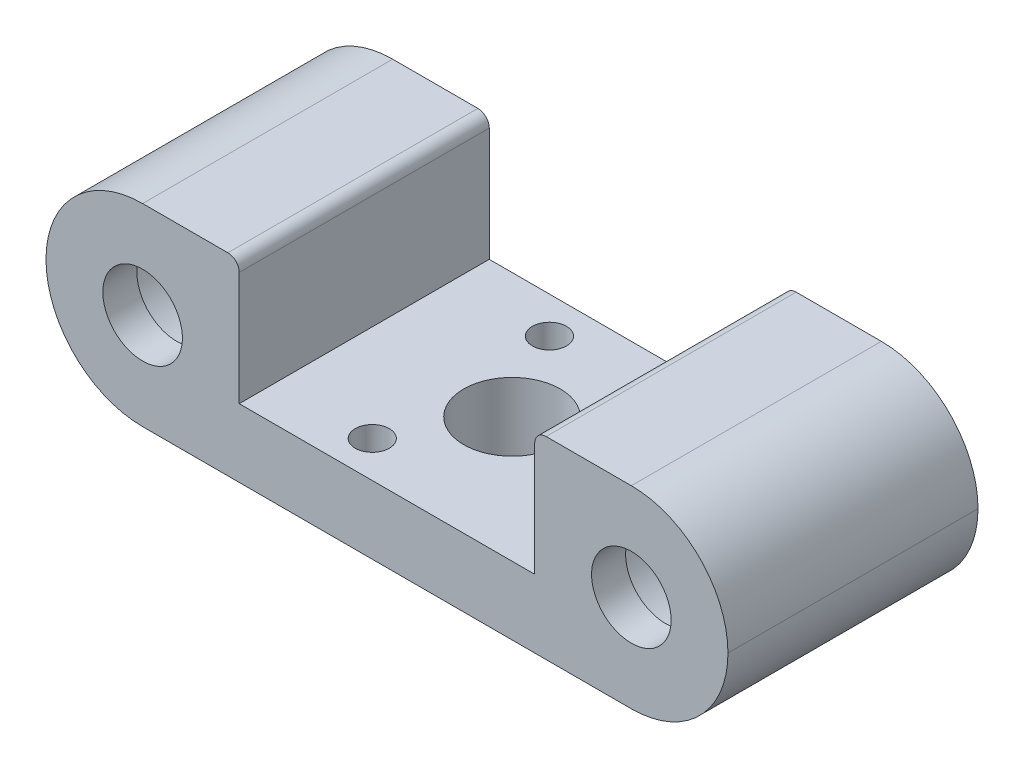
ISO-10303-21;
HEADER;
FILE_DESCRIPTION(('STEP AP214'),'2;1');
FILE_NAME('part.step','',(''),(''),'','','');
FILE_SCHEMA(('AUTOMOTIVE_DESIGN { 1 0 10303 214 1 1 1 1 }'));
ENDSEC;
DATA;
#1=APPLICATION_CONTEXT('core data for automotive mechanical design processes');
#2=APPLICATION_PROTOCOL_DEFINITION('international standard','automotive_design',2000,#1);
#3=PRODUCT_CONTEXT('',#1,'mechanical');
#4=PRODUCT('Part','Part','',(#3));
#5=PRODUCT_RELATED_PRODUCT_CATEGORY('part','',(#4));
#6=PRODUCT_DEFINITION_FORMATION('','',#4);
#7=PRODUCT_DEFINITION_CONTEXT('part definition',#1,'design');
#8=PRODUCT_DEFINITION('design','',#6,#7);
#9=PRODUCT_DEFINITION_SHAPE('','',#8);
#10=(LENGTH_UNIT() NAMED_UNIT(*) SI_UNIT(.MILLI.,.METRE.));
#11=(NAMED_UNIT(*) PLANE_ANGLE_UNIT() SI_UNIT($,.RADIAN.));
#12=(NAMED_UNIT(*) SI_UNIT($,.STERADIAN.) SOLID_ANGLE_UNIT());
#13=UNCERTAINTY_MEASURE_WITH_UNIT(LENGTH_MEASURE(1.E-05),#10,'distance_accuracy_value','');
#14=(GEOMETRIC_REPRESENTATION_CONTEXT(3) GLOBAL_UNCERTAINTY_ASSIGNED_CONTEXT((#13)) GLOBAL_UNIT_ASSIGNED_CONTEXT((#10,
#11,#12)) REPRESENTATION_CONTEXT('',''));
#15=CARTESIAN_POINT('',(0.,0.,0.));
#16=DIRECTION('',(0.,0.,1.));
#17=DIRECTION('',(1.,0.,0.));
#18=AXIS2_PLACEMENT_3D('',#15,#16,#17);
#19=CARTESIAN_POINT('',(21.5,8.50000000000001,0.));
#20=DIRECTION('',(0.,0.,1.));
#21=DIRECTION('',(1.,0.,0.));
#22=AXIS2_PLACEMENT_3D('',#19,#20,#21);
#23=CYLINDRICAL_SURFACE('',#22,6.1);
#24=CARTESIAN_POINT('',(21.5,8.50000000000001,0.));
#25=DIRECTION('',(0.,0.,1.));
#26=DIRECTION('',(1.,0.,0.));
#27=AXIS2_PLACEMENT_3D('',#24,#25,#26);
#28=CIRCLE('',#27,6.1);
#29=CARTESIAN_POINT('',(27.6,8.50000000000001,0.));
#30=VERTEX_POINT('',#29);
#31=EDGE_CURVE('E226',#30,#30,#28,.T.);
#32=ORIENTED_EDGE('',*,*,#31,.F.);
#33=EDGE_LOOP('',(#32));
#34=FACE_BOUND('',#33,.T.);
#35=CARTESIAN_POINT('',(21.5,8.50000000000001,19.));
#36=DIRECTION('',(0.,0.,1.));
#37=DIRECTION('',(1.,0.,0.));
#38=AXIS2_PLACEMENT_3D('',#35,#36,#37);
#39=CIRCLE('',#38,6.1);
#40=CARTESIAN_POINT('',(27.6,8.50000000000001,19.));
#41=VERTEX_POINT('',#40);
#42=EDGE_CURVE('E179',#41,#41,#39,.F.);
#43=ORIENTED_EDGE('',*,*,#42,.F.);
#44=EDGE_LOOP('',(#43));
#45=FACE_BOUND('',#44,.T.);
#46=ADVANCED_FACE('F32',(#34,#45),#23,.F.);
#47=CARTESIAN_POINT('',(13.,6.,22.));
#48=DIRECTION('',(0.,-1.,0.));
#49=DIRECTION('',(0.,0.,-1.));
#50=AXIS2_PLACEMENT_3D('',#47,#48,#49);
#51=PLANE('',#50);
#52=CARTESIAN_POINT('',(-4.5,6.,3.20577136594005));
#53=DIRECTION('',(0.,1.,0.));
#54=DIRECTION('',(0.,0.,1.));
#55=AXIS2_PLACEMENT_3D('',#52,#53,#54);
#56=CIRCLE('',#55,1.5);
#57=CARTESIAN_POINT('',(-4.5,6.,4.70577136594005));
#58=VERTEX_POINT('',#57);
#59=EDGE_CURVE('E256',#58,#58,#56,.T.);
#60=ORIENTED_EDGE('',*,*,#59,.F.);
#61=EDGE_LOOP('',(#60));
#62=FACE_BOUND('',#61,.T.);
#63=CARTESIAN_POINT('',(-4.49999999999999,6.,18.7942286340599));
#64=DIRECTION('',(0.,1.,0.));
#65=DIRECTION('',(0.,0.,1.));
#66=AXIS2_PLACEMENT_3D('',#63,#64,#65);
#67=CIRCLE('',#66,1.5);
#68=CARTESIAN_POINT('',(-4.49999999999999,6.,20.2942286340599));
#69=VERTEX_POINT('',#68);
#70=EDGE_CURVE('E250',#69,#69,#67,.T.);
#71=ORIENTED_EDGE('',*,*,#70,.F.);
#72=EDGE_LOOP('',(#71));
#73=FACE_BOUND('',#72,.T.);
#74=CARTESIAN_POINT('',(9.,6.,11.));
#75=DIRECTION('',(0.,1.,0.));
#76=DIRECTION('',(0.,0.,1.));
#77=AXIS2_PLACEMENT_3D('',#74,#75,#76);
#78=CIRCLE('',#77,1.5);
#79=CARTESIAN_POINT('',(9.,6.,12.5));
#80=VERTEX_POINT('',#79);
#81=EDGE_CURVE('E244',#80,#80,#78,.T.);
#82=ORIENTED_EDGE('',*,*,#81,.F.);
#83=EDGE_LOOP('',(#82));
#84=FACE_BOUND('',#83,.T.);
#85=CARTESIAN_POINT('',(0.,6.,11.));
#86=DIRECTION('',(0.,-1.,0.));
#87=DIRECTION('',(0.,0.,-1.));
#88=AXIS2_PLACEMENT_3D('',#85,#86,#87);
#89=CIRCLE('',#88,4.25);
#90=CARTESIAN_POINT('',(0.,6.,6.75));
#91=VERTEX_POINT('',#90);
#92=EDGE_CURVE('E239',#91,#91,#89,.T.);
#93=ORIENTED_EDGE('',*,*,#92,.T.);
#94=EDGE_LOOP('',(#93));
#95=FACE_BOUND('',#94,.T.);
#96=DIRECTION('',(-1.,0.,0.));
#97=VECTOR('',#96,1.);
#98=CARTESIAN_POINT('',(13.,6.,0.));
#99=LINE('',#98,#97);
#100=CARTESIAN_POINT('',(13.,6.,0.));
#101=VERTEX_POINT('',#100);
#102=CARTESIAN_POINT('',(-13.,6.,0.));
#103=VERTEX_POINT('',#102);
#104=EDGE_CURVE('E145',#101,#103,#99,.T.);
#105=ORIENTED_EDGE('',*,*,#104,.T.);
#106=DIRECTION('',(0.,0.,-1.));
#107=VECTOR('',#106,1.);
#108=CARTESIAN_POINT('',(-13.,6.,22.));
#109=LINE('',#108,#107);
#110=CARTESIAN_POINT('',(-13.,6.,22.));
#111=VERTEX_POINT('',#110);
#112=EDGE_CURVE('E126',#111,#103,#109,.T.);
#113=ORIENTED_EDGE('',*,*,#112,.F.);
#114=DIRECTION('',(-1.,0.,0.));
#115=VECTOR('',#114,1.);
#116=CARTESIAN_POINT('',(13.,6.,22.));
#117=LINE('',#116,#115);
#118=CARTESIAN_POINT('',(13.,6.,22.));
#119=VERTEX_POINT('',#118);
#120=EDGE_CURVE('E132',#119,#111,#117,.T.);
#121=ORIENTED_EDGE('',*,*,#120,.F.);
#122=DIRECTION('',(0.,0.,-1.));
#123=VECTOR('',#122,1.);
#124=CARTESIAN_POINT('',(13.,6.,22.));
#125=LINE('',#124,#123);
#126=EDGE_CURVE('E147',#119,#101,#125,.T.);
#127=ORIENTED_EDGE('',*,*,#126,.T.);
#128=EDGE_LOOP('',(#105,#113,#121,#127));
#129=FACE_BOUND('',#128,.T.);
#130=ADVANCED_FACE('F143',(#62,#73,#84,#95,#129),#51,.F.);
#131=CARTESIAN_POINT('',(-13.,17.,22.));
#132=DIRECTION('',(-1.,0.,0.));
#133=DIRECTION('',(0.,0.,1.));
#134=AXIS2_PLACEMENT_3D('',#131,#132,#133);
#135=PLANE('',#134);
#136=DIRECTION('',(0.,1.,0.));
#137=VECTOR('',#136,1.);
#138=CARTESIAN_POINT('',(-13.,17.,0.));
#139=LINE('',#138,#137);
#140=CARTESIAN_POINT('',(-13.,16.,0.));
#141=VERTEX_POINT('',#140);
#142=EDGE_CURVE('E223',#103,#141,#139,.T.);
#143=ORIENTED_EDGE('',*,*,#142,.T.);
#144=DIRECTION('',(0.,0.,-1.));
#145=VECTOR('',#144,1.);
#146=CARTESIAN_POINT('',(-13.,16.,22.));
#147=LINE('',#146,#145);
#148=CARTESIAN_POINT('',(-13.,16.,22.));
#149=VERTEX_POINT('',#148);
#150=EDGE_CURVE('E129',#141,#149,#147,.F.);
#151=ORIENTED_EDGE('',*,*,#150,.T.);
#152=DIRECTION('',(0.,1.,0.));
#153=VECTOR('',#152,1.);
#154=CARTESIAN_POINT('',(-13.,17.,22.));
#155=LINE('',#154,#153);
#156=EDGE_CURVE('E121',#111,#149,#155,.T.);
#157=ORIENTED_EDGE('',*,*,#156,.F.);
#158=ORIENTED_EDGE('',*,*,#112,.T.);
#159=EDGE_LOOP('',(#143,#151,#157,#158));
#160=FACE_BOUND('',#159,.T.);
#161=ADVANCED_FACE('F124',(#160),#135,.F.);
#162=CARTESIAN_POINT('',(-30.,17.,22.));
#163=DIRECTION('',(0.,-1.,0.));
#164=DIRECTION('',(1.,0.,0.));
#165=AXIS2_PLACEMENT_3D('',#162,#163,#164);
#166=PLANE('',#165);
#167=DIRECTION('',(-1.,0.,0.));
#168=VECTOR('',#167,1.);
#169=CARTESIAN_POINT('',(-30.,17.,22.));
#170=LINE('',#169,#168);
#171=CARTESIAN_POINT('',(-14.,17.,22.));
#172=VERTEX_POINT('',#171);
#173=CARTESIAN_POINT('',(-21.5,17.,22.));
#174=VERTEX_POINT('',#173);
#175=EDGE_CURVE('E131',#172,#174,#170,.T.);
#176=ORIENTED_EDGE('',*,*,#175,.F.);
#177=DIRECTION('',(0.,0.,-1.));
#178=VECTOR('',#177,1.);
#179=CARTESIAN_POINT('',(-14.,17.,22.));
#180=LINE('',#179,#178);
#181=CARTESIAN_POINT('',(-14.,17.,0.));
#182=VERTEX_POINT('',#181);
#183=EDGE_CURVE('E190',#172,#182,#180,.T.);
#184=ORIENTED_EDGE('',*,*,#183,.T.);
#185=DIRECTION('',(-1.,0.,0.));
#186=VECTOR('',#185,1.);
#187=CARTESIAN_POINT('',(-30.,17.,0.));
#188=LINE('',#187,#186);
#189=CARTESIAN_POINT('',(-21.5,17.,0.));
#190=VERTEX_POINT('',#189);
#191=EDGE_CURVE('E221',#182,#190,#188,.T.);
#192=ORIENTED_EDGE('',*,*,#191,.T.);
#193=DIRECTION('',(0.,0.,-1.));
#194=VECTOR('',#193,1.);
#195=CARTESIAN_POINT('',(-21.5,17.,22.));
#196=LINE('',#195,#194);
#197=EDGE_CURVE('E176',#190,#174,#196,.F.);
#198=ORIENTED_EDGE('',*,*,#197,.T.);
#199=EDGE_LOOP('',(#176,#184,#192,#198));
#200=FACE_BOUND('',#199,.T.);
#201=ADVANCED_FACE('F470',(#200),#166,.F.);
#202=CARTESIAN_POINT('',(-30.,0.,22.));
#203=DIRECTION('',(0.,1.,0.));
#204=DIRECTION('',(0.,0.,1.));
#205=AXIS2_PLACEMENT_3D('',#202,#203,#204);
#206=PLANE('',#205);
#207=CARTESIAN_POINT('',(-4.5,0.,3.20577136594005));
#208=DIRECTION('',(0.,1.,0.));
#209=DIRECTION('',(0.,0.,1.));
#210=AXIS2_PLACEMENT_3D('',#207,#208,#209);
#211=CIRCLE('',#210,1.5);
#212=CARTESIAN_POINT('',(-4.5,0.,4.70577136594005));
#213=VERTEX_POINT('',#212);
#214=EDGE_CURVE('E253',#213,#213,#211,.T.);
#215=ORIENTED_EDGE('',*,*,#214,.T.);
#216=EDGE_LOOP('',(#215));
#217=FACE_BOUND('',#216,.T.);
#218=CARTESIAN_POINT('',(-4.49999999999999,0.,18.7942286340599));
#219=DIRECTION('',(0.,1.,0.));
#220=DIRECTION('',(0.,0.,1.));
#221=AXIS2_PLACEMENT_3D('',#218,#219,#220);
#222=CIRCLE('',#221,1.5);
#223=CARTESIAN_POINT('',(-4.49999999999999,0.,20.2942286340599));
#224=VERTEX_POINT('',#223);
#225=EDGE_CURVE('E247',#224,#224,#222,.T.);
#226=ORIENTED_EDGE('',*,*,#225,.T.);
#227=EDGE_LOOP('',(#226));
#228=FACE_BOUND('',#227,.T.);
#229=CARTESIAN_POINT('',(9.,0.,11.));
#230=DIRECTION('',(0.,1.,0.));
#231=DIRECTION('',(0.,0.,1.));
#232=AXIS2_PLACEMENT_3D('',#229,#230,#231);
#233=CIRCLE('',#232,1.5);
#234=CARTESIAN_POINT('',(9.,0.,12.5));
#235=VERTEX_POINT('',#234);
#236=EDGE_CURVE('E187',#235,#235,#233,.T.);
#237=ORIENTED_EDGE('',*,*,#236,.T.);
#238=EDGE_LOOP('',(#237));
#239=FACE_BOUND('',#238,.T.);
#240=CARTESIAN_POINT('',(0.,0.,11.));
#241=DIRECTION('',(0.,-1.,0.));
#242=DIRECTION('',(0.,0.,-1.));
#243=AXIS2_PLACEMENT_3D('',#240,#241,#242);
#244=CIRCLE('',#243,4.25);
#245=CARTESIAN_POINT('',(0.,0.,6.75));
#246=VERTEX_POINT('',#245);
#247=EDGE_CURVE('E183',#246,#246,#244,.T.);
#248=ORIENTED_EDGE('',*,*,#247,.F.);
#249=EDGE_LOOP('',(#248));
#250=FACE_BOUND('',#249,.T.);
#251=DIRECTION('',(1.,0.,0.));
#252=VECTOR('',#251,1.);
#253=CARTESIAN_POINT('',(-30.,0.,0.));
#254=LINE('',#253,#252);
#255=CARTESIAN_POINT('',(-21.5,0.,0.));
#256=VERTEX_POINT('',#255);
#257=CARTESIAN_POINT('',(21.5,0.,0.));
#258=VERTEX_POINT('',#257);
#259=EDGE_CURVE('E216',#256,#258,#254,.T.);
#260=ORIENTED_EDGE('',*,*,#259,.T.);
#261=DIRECTION('',(0.,0.,-1.));
#262=VECTOR('',#261,1.);
#263=CARTESIAN_POINT('',(21.5,0.,22.));
#264=LINE('',#263,#262);
#265=CARTESIAN_POINT('',(21.5,0.,22.));
#266=VERTEX_POINT('',#265);
#267=EDGE_CURVE('E163',#258,#266,#264,.F.);
#268=ORIENTED_EDGE('',*,*,#267,.T.);
#269=DIRECTION('',(1.,0.,0.));
#270=VECTOR('',#269,1.);
#271=CARTESIAN_POINT('',(-30.,0.,22.));
#272=LINE('',#271,#270);
#273=CARTESIAN_POINT('',(-21.5,0.,22.));
#274=VERTEX_POINT('',#273);
#275=EDGE_CURVE('E230',#274,#266,#272,.T.);
#276=ORIENTED_EDGE('',*,*,#275,.F.);
#277=DIRECTION('',(0.,0.,-1.));
#278=VECTOR('',#277,1.);
#279=CARTESIAN_POINT('',(-21.5,0.,22.));
#280=LINE('',#279,#278);
#281=EDGE_CURVE('E160',#274,#256,#280,.T.);
#282=ORIENTED_EDGE('',*,*,#281,.T.);
#283=EDGE_LOOP('',(#260,#268,#276,#282));
#284=FACE_BOUND('',#283,.T.);
#285=ADVANCED_FACE('F466',(#217,#228,#239,#250,#284),#206,.F.);
#286=CARTESIAN_POINT('',(30.,17.,22.));
#287=DIRECTION('',(0.,-1.,0.));
#288=DIRECTION('',(1.,0.,0.));
#289=AXIS2_PLACEMENT_3D('',#286,#287,#288);
#290=PLANE('',#289);
#291=DIRECTION('',(-1.,0.,0.));
#292=VECTOR('',#291,1.);
#293=CARTESIAN_POINT('',(30.,17.,0.));
#294=LINE('',#293,#292);
#295=CARTESIAN_POINT('',(21.5,17.,0.));
#296=VERTEX_POINT('',#295);
#297=CARTESIAN_POINT('',(14.,17.,0.));
#298=VERTEX_POINT('',#297);
#299=EDGE_CURVE('E215',#296,#298,#294,.T.);
#300=ORIENTED_EDGE('',*,*,#299,.T.);
#301=DIRECTION('',(0.,0.,-1.));
#302=VECTOR('',#301,1.);
#303=CARTESIAN_POINT('',(14.,17.,22.));
#304=LINE('',#303,#302);
#305=CARTESIAN_POINT('',(14.,17.,22.));
#306=VERTEX_POINT('',#305);
#307=EDGE_CURVE('E11',#298,#306,#304,.F.);
#308=ORIENTED_EDGE('',*,*,#307,.T.);
#309=DIRECTION('',(-1.,0.,0.));
#310=VECTOR('',#309,1.);
#311=CARTESIAN_POINT('',(30.,17.,22.));
#312=LINE('',#311,#310);
#313=CARTESIAN_POINT('',(21.5,17.,22.));
#314=VERTEX_POINT('',#313);
#315=EDGE_CURVE('E228',#314,#306,#312,.T.);
#316=ORIENTED_EDGE('',*,*,#315,.F.);
#317=DIRECTION('',(0.,0.,-1.));
#318=VECTOR('',#317,1.);
#319=CARTESIAN_POINT('',(21.5,17.,22.));
#320=LINE('',#319,#318);
#321=EDGE_CURVE('E174',#314,#296,#320,.T.);
#322=ORIENTED_EDGE('',*,*,#321,.T.);
#323=EDGE_LOOP('',(#300,#308,#316,#322));
#324=FACE_BOUND('',#323,.T.);
#325=ADVANCED_FACE('F291',(#324),#290,.F.);
#326=CARTESIAN_POINT('',(13.,17.,22.));
#327=DIRECTION('',(1.,0.,0.));
#328=DIRECTION('',(0.,0.,-1.));
#329=AXIS2_PLACEMENT_3D('',#326,#327,#328);
#330=PLANE('',#329);
#331=DIRECTION('',(0.,-1.,0.));
#332=VECTOR('',#331,1.);
#333=CARTESIAN_POINT('',(13.,17.,22.));
#334=LINE('',#333,#332);
#335=CARTESIAN_POINT('',(13.,16.,22.));
#336=VERTEX_POINT('',#335);
#337=EDGE_CURVE('E137',#336,#119,#334,.T.);
#338=ORIENTED_EDGE('',*,*,#337,.F.);
#339=DIRECTION('',(0.,0.,-1.));
#340=VECTOR('',#339,1.);
#341=CARTESIAN_POINT('',(13.,16.,22.));
#342=LINE('',#341,#340);
#343=CARTESIAN_POINT('',(13.,16.,0.));
#344=VERTEX_POINT('',#343);
#345=EDGE_CURVE('E40',#336,#344,#342,.T.);
#346=ORIENTED_EDGE('',*,*,#345,.T.);
#347=DIRECTION('',(0.,-1.,0.));
#348=VECTOR('',#347,1.);
#349=CARTESIAN_POINT('',(13.,17.,0.));
#350=LINE('',#349,#348);
#351=EDGE_CURVE('E141',#344,#101,#350,.T.);
#352=ORIENTED_EDGE('',*,*,#351,.T.);
#353=ORIENTED_EDGE('',*,*,#126,.F.);
#354=EDGE_LOOP('',(#338,#346,#352,#353));
#355=FACE_BOUND('',#354,.T.);
#356=ADVANCED_FACE('F209',(#355),#330,.F.);
#357=CARTESIAN_POINT('',(0.,0.,22.));
#358=DIRECTION('',(0.,0.,1.));
#359=DIRECTION('',(1.,0.,0.));
#360=AXIS2_PLACEMENT_3D('',#357,#358,#359);
#361=PLANE('',#360);
#362=ORIENTED_EDGE('',*,*,#156,.T.);
#363=CARTESIAN_POINT('',(-14.,16.,22.));
#364=DIRECTION('',(0.,0.,1.));
#365=DIRECTION('',(1.,0.,0.));
#366=AXIS2_PLACEMENT_3D('',#363,#364,#365);
#367=CIRCLE('',#366,1.);
#368=EDGE_CURVE('E204',#149,#172,#367,.T.);
#369=ORIENTED_EDGE('',*,*,#368,.T.);
#370=ORIENTED_EDGE('',*,*,#175,.T.);
#371=CARTESIAN_POINT('',(-21.5,8.5,22.));
#372=DIRECTION('',(0.,0.,1.));
#373=DIRECTION('',(1.,0.,0.));
#374=AXIS2_PLACEMENT_3D('',#371,#372,#373);
#375=CIRCLE('',#374,8.5);
#376=CARTESIAN_POINT('',(-30.,8.5,22.));
#377=VERTEX_POINT('',#376);
#378=EDGE_CURVE('E166',#174,#377,#375,.T.);
#379=ORIENTED_EDGE('',*,*,#378,.T.);
#380=CARTESIAN_POINT('',(-21.5,8.5,22.));
#381=DIRECTION('',(0.,0.,1.));
#382=DIRECTION('',(1.,0.,0.));
#383=AXIS2_PLACEMENT_3D('',#380,#381,#382);
#384=CIRCLE('',#383,8.5);
#385=EDGE_CURVE('E168',#377,#274,#384,.T.);
#386=ORIENTED_EDGE('',*,*,#385,.T.);
#387=ORIENTED_EDGE('',*,*,#275,.T.);
#388=CARTESIAN_POINT('',(21.5,8.5,22.));
#389=DIRECTION('',(0.,0.,1.));
#390=DIRECTION('',(1.,0.,0.));
#391=AXIS2_PLACEMENT_3D('',#388,#389,#390);
#392=CIRCLE('',#391,8.5);
#393=CARTESIAN_POINT('',(30.,8.5,22.));
#394=VERTEX_POINT('',#393);
#395=EDGE_CURVE('E172',#266,#394,#392,.T.);
#396=ORIENTED_EDGE('',*,*,#395,.T.);
#397=CARTESIAN_POINT('',(21.5,8.5,22.));
#398=DIRECTION('',(0.,0.,1.));
#399=DIRECTION('',(1.,0.,0.));
#400=AXIS2_PLACEMENT_3D('',#397,#398,#399);
#401=CIRCLE('',#400,8.5);
#402=EDGE_CURVE('E170',#394,#314,#401,.T.);
#403=ORIENTED_EDGE('',*,*,#402,.T.);
#404=ORIENTED_EDGE('',*,*,#315,.T.);
#405=CARTESIAN_POINT('',(14.,16.,22.));
#406=DIRECTION('',(0.,0.,1.));
#407=DIRECTION('',(1.,0.,0.));
#408=AXIS2_PLACEMENT_3D('',#405,#406,#407);
#409=CIRCLE('',#408,1.);
#410=EDGE_CURVE('E47',#306,#336,#409,.T.);
#411=ORIENTED_EDGE('',*,*,#410,.T.);
#412=ORIENTED_EDGE('',*,*,#337,.T.);
#413=ORIENTED_EDGE('',*,*,#120,.T.);
#414=EDGE_LOOP('',(#362,#369,#370,#379,#386,#387,#396,#403,#404,#411,#412,#413));
#415=FACE_BOUND('',#414,.T.);
#416=CARTESIAN_POINT('',(21.5,8.50000000000001,22.));
#417=DIRECTION('',(0.,0.,1.));
#418=DIRECTION('',(1.,0.,0.));
#419=AXIS2_PLACEMENT_3D('',#416,#417,#418);
#420=CIRCLE('',#419,3.5);
#421=CARTESIAN_POINT('',(25.,8.50000000000001,22.));
#422=VERTEX_POINT('',#421);
#423=EDGE_CURVE('E194',#422,#422,#420,.T.);
#424=ORIENTED_EDGE('',*,*,#423,.F.);
#425=EDGE_LOOP('',(#424));
#426=FACE_BOUND('',#425,.T.);
#427=CARTESIAN_POINT('',(-21.5,8.50000000000007,22.));
#428=DIRECTION('',(0.,0.,1.));
#429=DIRECTION('',(-1.,0.,0.));
#430=AXIS2_PLACEMENT_3D('',#427,#428,#429);
#431=CIRCLE('',#430,3.5);
#432=CARTESIAN_POINT('',(-25.,8.50000000000007,22.));
#433=VERTEX_POINT('',#432);
#434=EDGE_CURVE('E266',#433,#433,#431,.T.);
#435=ORIENTED_EDGE('',*,*,#434,.F.);
#436=EDGE_LOOP('',(#435));
#437=FACE_BOUND('',#436,.T.);
#438=ADVANCED_FACE('F135',(#415,#426,#437),#361,.T.);
#439=CARTESIAN_POINT('',(0.,0.,0.));
#440=DIRECTION('',(0.,0.,1.));
#441=DIRECTION('',(1.,0.,0.));
#442=AXIS2_PLACEMENT_3D('',#439,#440,#441);
#443=PLANE('',#442);
#444=CARTESIAN_POINT('',(-21.5,8.50000000000001,0.));
#445=DIRECTION('',(0.,0.,1.));
#446=DIRECTION('',(-1.,0.,0.));
#447=AXIS2_PLACEMENT_3D('',#444,#445,#446);
#448=CIRCLE('',#447,6.1);
#449=CARTESIAN_POINT('',(-27.6,8.50000000000001,0.));
#450=VERTEX_POINT('',#449);
#451=EDGE_CURVE('E236',#450,#450,#448,.T.);
#452=ORIENTED_EDGE('',*,*,#451,.T.);
#453=EDGE_LOOP('',(#452));
#454=FACE_BOUND('',#453,.T.);
#455=ORIENTED_EDGE('',*,*,#31,.T.);
#456=EDGE_LOOP('',(#455));
#457=FACE_BOUND('',#456,.T.);
#458=ORIENTED_EDGE('',*,*,#191,.F.);
#459=CARTESIAN_POINT('',(-14.,16.,0.));
#460=DIRECTION('',(0.,0.,1.));
#461=DIRECTION('',(1.,0.,0.));
#462=AXIS2_PLACEMENT_3D('',#459,#460,#461);
#463=CIRCLE('',#462,1.);
#464=EDGE_CURVE('E200',#182,#141,#463,.F.);
#465=ORIENTED_EDGE('',*,*,#464,.T.);
#466=ORIENTED_EDGE('',*,*,#142,.F.);
#467=ORIENTED_EDGE('',*,*,#104,.F.);
#468=ORIENTED_EDGE('',*,*,#351,.F.);
#469=CARTESIAN_POINT('',(14.,16.,0.));
#470=DIRECTION('',(0.,0.,1.));
#471=DIRECTION('',(1.,0.,0.));
#472=AXIS2_PLACEMENT_3D('',#469,#470,#471);
#473=CIRCLE('',#472,1.);
#474=EDGE_CURVE('E198',#344,#298,#473,.F.);
#475=ORIENTED_EDGE('',*,*,#474,.T.);
#476=ORIENTED_EDGE('',*,*,#299,.F.);
#477=CARTESIAN_POINT('',(21.5,8.5,0.));
#478=DIRECTION('',(0.,0.,1.));
#479=DIRECTION('',(1.,0.,0.));
#480=AXIS2_PLACEMENT_3D('',#477,#478,#479);
#481=CIRCLE('',#480,8.5);
#482=CARTESIAN_POINT('',(30.,8.5,0.));
#483=VERTEX_POINT('',#482);
#484=EDGE_CURVE('E156',#296,#483,#481,.F.);
#485=ORIENTED_EDGE('',*,*,#484,.T.);
#486=CARTESIAN_POINT('',(21.5,8.5,0.));
#487=DIRECTION('',(0.,0.,1.));
#488=DIRECTION('',(1.,0.,0.));
#489=AXIS2_PLACEMENT_3D('',#486,#487,#488);
#490=CIRCLE('',#489,8.5);
#491=EDGE_CURVE('E158',#483,#258,#490,.F.);
#492=ORIENTED_EDGE('',*,*,#491,.T.);
#493=ORIENTED_EDGE('',*,*,#259,.F.);
#494=CARTESIAN_POINT('',(-21.5,8.5,0.));
#495=DIRECTION('',(0.,0.,1.));
#496=DIRECTION('',(1.,0.,0.));
#497=AXIS2_PLACEMENT_3D('',#494,#495,#496);
#498=CIRCLE('',#497,8.5);
#499=CARTESIAN_POINT('',(-30.,8.5,0.));
#500=VERTEX_POINT('',#499);
#501=EDGE_CURVE('E150',#256,#500,#498,.F.);
#502=ORIENTED_EDGE('',*,*,#501,.T.);
#503=CARTESIAN_POINT('',(-21.5,8.5,0.));
#504=DIRECTION('',(0.,0.,1.));
#505=DIRECTION('',(1.,0.,0.));
#506=AXIS2_PLACEMENT_3D('',#503,#504,#505);
#507=CIRCLE('',#506,8.5);
#508=EDGE_CURVE('E146',#500,#190,#507,.F.);
#509=ORIENTED_EDGE('',*,*,#508,.T.);
#510=EDGE_LOOP('',(#458,#465,#466,#467,#468,#475,#476,#485,#492,#493,#502,#509));
#511=FACE_BOUND('',#510,.T.);
#512=ADVANCED_FACE('F213',(#454,#457,#511),#443,.F.);
#513=CARTESIAN_POINT('',(-21.5,8.50000000000001,0.));
#514=DIRECTION('',(0.,0.,1.));
#515=DIRECTION('',(1.,0.,0.));
#516=AXIS2_PLACEMENT_3D('',#513,#514,#515);
#517=CYLINDRICAL_SURFACE('',#516,6.1);
#518=CARTESIAN_POINT('',(-21.5,8.50000000000001,19.));
#519=DIRECTION('',(0.,0.,-1.));
#520=DIRECTION('',(-1.,0.,0.));
#521=AXIS2_PLACEMENT_3D('',#518,#519,#520);
#522=CIRCLE('',#521,6.1);
#523=CARTESIAN_POINT('',(-27.6,8.50000000000001,19.));
#524=VERTEX_POINT('',#523);
#525=EDGE_CURVE('E191',#524,#524,#522,.F.);
#526=ORIENTED_EDGE('',*,*,#525,.T.);
#527=EDGE_LOOP('',(#526));
#528=FACE_BOUND('',#527,.T.);
#529=ORIENTED_EDGE('',*,*,#451,.F.);
#530=EDGE_LOOP('',(#529));
#531=FACE_BOUND('',#530,.T.);
#532=ADVANCED_FACE('F288',(#528,#531),#517,.F.);
#533=CARTESIAN_POINT('',(0.,17.,11.));
#534=DIRECTION('',(0.,-1.,0.));
#535=DIRECTION('',(0.,0.,-1.));
#536=AXIS2_PLACEMENT_3D('',#533,#534,#535);
#537=CYLINDRICAL_SURFACE('',#536,4.25);
#538=ORIENTED_EDGE('',*,*,#247,.T.);
#539=EDGE_LOOP('',(#538));
#540=FACE_BOUND('',#539,.T.);
#541=ORIENTED_EDGE('',*,*,#92,.F.);
#542=EDGE_LOOP('',(#541));
#543=FACE_BOUND('',#542,.T.);
#544=ADVANCED_FACE('F306',(#540,#543),#537,.F.);
#545=CARTESIAN_POINT('',(21.5,8.5,22.));
#546=DIRECTION('',(0.,0.,-1.));
#547=DIRECTION('',(-1.,0.,0.));
#548=AXIS2_PLACEMENT_3D('',#545,#546,#547);
#549=CYLINDRICAL_SURFACE('',#548,8.5);
#550=ORIENTED_EDGE('',*,*,#321,.F.);
#551=ORIENTED_EDGE('',*,*,#402,.F.);
#552=DIRECTION('',(0.,0.,-1.));
#553=VECTOR('',#552,1.);
#554=CARTESIAN_POINT('',(30.,8.5,22.));
#555=LINE('',#554,#553);
#556=EDGE_CURVE('E180',#483,#394,#555,.F.);
#557=ORIENTED_EDGE('',*,*,#556,.F.);
#558=ORIENTED_EDGE('',*,*,#484,.F.);
#559=EDGE_LOOP('',(#550,#551,#557,#558));
#560=FACE_BOUND('',#559,.T.);
#561=ADVANCED_FACE('F310',(#560),#549,.T.);
#562=CARTESIAN_POINT('',(21.5,8.5,22.));
#563=DIRECTION('',(0.,0.,-1.));
#564=DIRECTION('',(-1.,0.,0.));
#565=AXIS2_PLACEMENT_3D('',#562,#563,#564);
#566=CYLINDRICAL_SURFACE('',#565,8.5);
#567=ORIENTED_EDGE('',*,*,#395,.F.);
#568=ORIENTED_EDGE('',*,*,#267,.F.);
#569=ORIENTED_EDGE('',*,*,#491,.F.);
#570=ORIENTED_EDGE('',*,*,#556,.T.);
#571=EDGE_LOOP('',(#567,#568,#569,#570));
#572=FACE_BOUND('',#571,.T.);
#573=ADVANCED_FACE('F404',(#572),#566,.T.);
#574=CARTESIAN_POINT('',(-21.5,8.5,22.));
#575=DIRECTION('',(0.,0.,-1.));
#576=DIRECTION('',(-1.,0.,0.));
#577=AXIS2_PLACEMENT_3D('',#574,#575,#576);
#578=CYLINDRICAL_SURFACE('',#577,8.5);
#579=DIRECTION('',(0.,0.,-1.));
#580=VECTOR('',#579,1.);
#581=CARTESIAN_POINT('',(-30.,8.5,22.));
#582=LINE('',#581,#580);
#583=EDGE_CURVE('E184',#377,#500,#582,.T.);
#584=ORIENTED_EDGE('',*,*,#583,.F.);
#585=ORIENTED_EDGE('',*,*,#378,.F.);
#586=ORIENTED_EDGE('',*,*,#197,.F.);
#587=ORIENTED_EDGE('',*,*,#508,.F.);
#588=EDGE_LOOP('',(#584,#585,#586,#587));
#589=FACE_BOUND('',#588,.T.);
#590=ADVANCED_FACE('F412',(#589),#578,.T.);
#591=CARTESIAN_POINT('',(-21.5,8.5,22.));
#592=DIRECTION('',(0.,0.,-1.));
#593=DIRECTION('',(-1.,0.,0.));
#594=AXIS2_PLACEMENT_3D('',#591,#592,#593);
#595=CYLINDRICAL_SURFACE('',#594,8.5);
#596=ORIENTED_EDGE('',*,*,#385,.F.);
#597=ORIENTED_EDGE('',*,*,#583,.T.);
#598=ORIENTED_EDGE('',*,*,#501,.F.);
#599=ORIENTED_EDGE('',*,*,#281,.F.);
#600=EDGE_LOOP('',(#596,#597,#598,#599));
#601=FACE_BOUND('',#600,.T.);
#602=ADVANCED_FACE('F316',(#601),#595,.T.);
#603=CARTESIAN_POINT('',(9.,0.,11.));
#604=DIRECTION('',(0.,1.,0.));
#605=DIRECTION('',(0.,0.,1.));
#606=AXIS2_PLACEMENT_3D('',#603,#604,#605);
#607=CYLINDRICAL_SURFACE('',#606,1.5);
#608=ORIENTED_EDGE('',*,*,#236,.F.);
#609=EDGE_LOOP('',(#608));
#610=FACE_BOUND('',#609,.T.);
#611=ORIENTED_EDGE('',*,*,#81,.T.);
#612=EDGE_LOOP('',(#611));
#613=FACE_BOUND('',#612,.T.);
#614=ADVANCED_FACE('F312',(#610,#613),#607,.F.);
#615=CARTESIAN_POINT('',(-4.49999999999999,0.,18.7942286340599));
#616=DIRECTION('',(0.,1.,0.));
#617=DIRECTION('',(0.,0.,1.));
#618=AXIS2_PLACEMENT_3D('',#615,#616,#617);
#619=CYLINDRICAL_SURFACE('',#618,1.5);
#620=ORIENTED_EDGE('',*,*,#225,.F.);
#621=EDGE_LOOP('',(#620));
#622=FACE_BOUND('',#621,.T.);
#623=ORIENTED_EDGE('',*,*,#70,.T.);
#624=EDGE_LOOP('',(#623));
#625=FACE_BOUND('',#624,.T.);
#626=ADVANCED_FACE('F315',(#622,#625),#619,.F.);
#627=CARTESIAN_POINT('',(-4.5,0.,3.20577136594005));
#628=DIRECTION('',(0.,1.,0.));
#629=DIRECTION('',(0.,0.,1.));
#630=AXIS2_PLACEMENT_3D('',#627,#628,#629);
#631=CYLINDRICAL_SURFACE('',#630,1.5);
#632=ORIENTED_EDGE('',*,*,#214,.F.);
#633=EDGE_LOOP('',(#632));
#634=FACE_BOUND('',#633,.T.);
#635=ORIENTED_EDGE('',*,*,#59,.T.);
#636=EDGE_LOOP('',(#635));
#637=FACE_BOUND('',#636,.T.);
#638=ADVANCED_FACE('F320',(#634,#637),#631,.F.);
#639=CARTESIAN_POINT('',(21.5,8.50000000000001,19.));
#640=DIRECTION('',(0.,0.,1.));
#641=DIRECTION('',(1.,0.,0.));
#642=AXIS2_PLACEMENT_3D('',#639,#640,#641);
#643=PLANE('',#642);
#644=CARTESIAN_POINT('',(21.5,8.50000000000001,19.));
#645=DIRECTION('',(0.,0.,1.));
#646=DIRECTION('',(1.,0.,0.));
#647=AXIS2_PLACEMENT_3D('',#644,#645,#646);
#648=CIRCLE('',#647,3.5);
#649=CARTESIAN_POINT('',(25.,8.50000000000001,19.));
#650=VERTEX_POINT('',#649);
#651=EDGE_CURVE('E259',#650,#650,#648,.T.);
#652=ORIENTED_EDGE('',*,*,#651,.T.);
#653=EDGE_LOOP('',(#652));
#654=FACE_BOUND('',#653,.T.);
#655=ORIENTED_EDGE('',*,*,#42,.T.);
#656=EDGE_LOOP('',(#655));
#657=FACE_BOUND('',#656,.T.);
#658=ADVANCED_FACE('F324',(#654,#657),#643,.F.);
#659=CARTESIAN_POINT('',(21.5,8.50000000000001,19.));
#660=DIRECTION('',(0.,0.,1.));
#661=DIRECTION('',(1.,0.,0.));
#662=AXIS2_PLACEMENT_3D('',#659,#660,#661);
#663=CYLINDRICAL_SURFACE('',#662,3.5);
#664=ORIENTED_EDGE('',*,*,#651,.F.);
#665=EDGE_LOOP('',(#664));
#666=FACE_BOUND('',#665,.T.);
#667=ORIENTED_EDGE('',*,*,#423,.T.);
#668=EDGE_LOOP('',(#667));
#669=FACE_BOUND('',#668,.T.);
#670=ADVANCED_FACE('F328',(#666,#669),#663,.F.);
#671=CARTESIAN_POINT('',(-21.5,8.50000000000007,19.));
#672=DIRECTION('',(0.,0.,-1.));
#673=DIRECTION('',(-1.,0.,0.));
#674=AXIS2_PLACEMENT_3D('',#671,#672,#673);
#675=PLANE('',#674);
#676=CARTESIAN_POINT('',(-21.5,8.50000000000007,19.));
#677=DIRECTION('',(0.,0.,1.));
#678=DIRECTION('',(-1.,0.,0.));
#679=AXIS2_PLACEMENT_3D('',#676,#677,#678);
#680=CIRCLE('',#679,3.5);
#681=CARTESIAN_POINT('',(-25.,8.50000000000007,19.));
#682=VERTEX_POINT('',#681);
#683=EDGE_CURVE('E195',#682,#682,#680,.T.);
#684=ORIENTED_EDGE('',*,*,#683,.T.);
#685=EDGE_LOOP('',(#684));
#686=FACE_BOUND('',#685,.T.);
#687=ORIENTED_EDGE('',*,*,#525,.F.);
#688=EDGE_LOOP('',(#687));
#689=FACE_BOUND('',#688,.T.);
#690=ADVANCED_FACE('F272',(#686,#689),#675,.T.);
#691=CARTESIAN_POINT('',(-21.5,8.50000000000007,19.));
#692=DIRECTION('',(0.,0.,1.));
#693=DIRECTION('',(1.,0.,0.));
#694=AXIS2_PLACEMENT_3D('',#691,#692,#693);
#695=CYLINDRICAL_SURFACE('',#694,3.5);
#696=ORIENTED_EDGE('',*,*,#683,.F.);
#697=EDGE_LOOP('',(#696));
#698=FACE_BOUND('',#697,.T.);
#699=ORIENTED_EDGE('',*,*,#434,.T.);
#700=EDGE_LOOP('',(#699));
#701=FACE_BOUND('',#700,.T.);
#702=ADVANCED_FACE('F275',(#698,#701),#695,.F.);
#703=CARTESIAN_POINT('',(-14.,16.,22.));
#704=DIRECTION('',(0.,0.,-1.));
#705=DIRECTION('',(-1.,0.,0.));
#706=AXIS2_PLACEMENT_3D('',#703,#704,#705);
#707=CYLINDRICAL_SURFACE('',#706,1.);
#708=ORIENTED_EDGE('',*,*,#368,.F.);
#709=ORIENTED_EDGE('',*,*,#150,.F.);
#710=ORIENTED_EDGE('',*,*,#464,.F.);
#711=ORIENTED_EDGE('',*,*,#183,.F.);
#712=EDGE_LOOP('',(#708,#709,#710,#711));
#713=FACE_BOUND('',#712,.T.);
#714=ADVANCED_FACE('F278',(#713),#707,.T.);
#715=CARTESIAN_POINT('',(14.,16.,22.));
#716=DIRECTION('',(0.,0.,-1.));
#717=DIRECTION('',(-1.,0.,0.));
#718=AXIS2_PLACEMENT_3D('',#715,#716,#717);
#719=CYLINDRICAL_SURFACE('',#718,1.);
#720=ORIENTED_EDGE('',*,*,#410,.F.);
#721=ORIENTED_EDGE('',*,*,#307,.F.);
#722=ORIENTED_EDGE('',*,*,#474,.F.);
#723=ORIENTED_EDGE('',*,*,#345,.F.);
#724=EDGE_LOOP('',(#720,#721,#722,#723));
#725=FACE_BOUND('',#724,.T.);
#726=ADVANCED_FACE('F34',(#725),#719,.T.);
#727=CLOSED_SHELL('',(#46,#130,#161,#201,#285,#325,#356,#438,#512,#532,#544,#561,#573,#590,#602,
#614,#626,#638,#658,#670,#690,#702,#714,#726));
#728=MANIFOLD_SOLID_BREP('B2',#727);
#729=ADVANCED_BREP_SHAPE_REPRESENTATION('',(#18,#728),#14);
#730=SHAPE_DEFINITION_REPRESENTATION(#9,#729);
ENDSEC;
END-ISO-10303-21;
